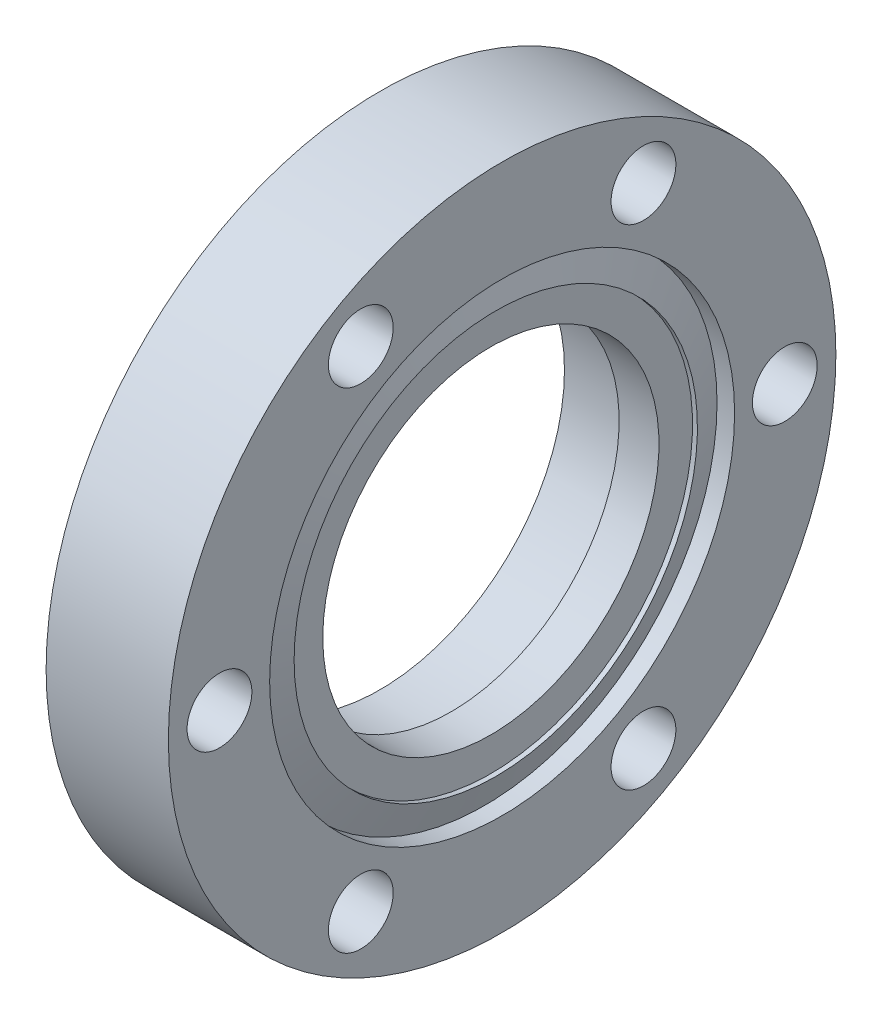
ISO-10303-21;
HEADER;
FILE_DESCRIPTION(('STEP AP214'),'2;1');
FILE_NAME('part.step','',(''),(''),'','','');
FILE_SCHEMA(('AUTOMOTIVE_DESIGN { 1 0 10303 214 1 1 1 1 }'));
ENDSEC;
DATA;
#1=APPLICATION_CONTEXT('core data for automotive mechanical design processes');
#2=APPLICATION_PROTOCOL_DEFINITION('international standard','automotive_design',2000,#1);
#3=PRODUCT_CONTEXT('',#1,'mechanical');
#4=PRODUCT('Part','Part','',(#3));
#5=PRODUCT_RELATED_PRODUCT_CATEGORY('part','',(#4));
#6=PRODUCT_DEFINITION_FORMATION('','',#4);
#7=PRODUCT_DEFINITION_CONTEXT('part definition',#1,'design');
#8=PRODUCT_DEFINITION('design','',#6,#7);
#9=PRODUCT_DEFINITION_SHAPE('','',#8);
#10=(LENGTH_UNIT() NAMED_UNIT(*) SI_UNIT(.MILLI.,.METRE.));
#11=(NAMED_UNIT(*) PLANE_ANGLE_UNIT() SI_UNIT($,.RADIAN.));
#12=(NAMED_UNIT(*) SI_UNIT($,.STERADIAN.) SOLID_ANGLE_UNIT());
#13=UNCERTAINTY_MEASURE_WITH_UNIT(LENGTH_MEASURE(1.E-05),#10,'distance_accuracy_value','');
#14=(GEOMETRIC_REPRESENTATION_CONTEXT(3) GLOBAL_UNCERTAINTY_ASSIGNED_CONTEXT((#13)) GLOBAL_UNIT_ASSIGNED_CONTEXT((#10,
#11,#12)) REPRESENTATION_CONTEXT('',''));
#15=CARTESIAN_POINT('',(0.,0.,0.));
#16=DIRECTION('',(0.,0.,1.));
#17=DIRECTION('',(1.,0.,0.));
#18=AXIS2_PLACEMENT_3D('',#15,#16,#17);
#19=CARTESIAN_POINT('',(5.18000000000051,-19.2062500000005,0.));
#20=DIRECTION('',(1.,0.,0.));
#21=DIRECTION('',(0.,0.,-1.));
#22=AXIS2_PLACEMENT_3D('',#19,#20,#21);
#23=PLANE('',#22);
#24=CARTESIAN_POINT('',(5.18000000000051,0.,0.));
#25=DIRECTION('',(-1.,0.,0.));
#26=DIRECTION('',(0.,0.,1.));
#27=AXIS2_PLACEMENT_3D('',#24,#25,#26);
#28=CIRCLE('',#27,17.4625);
#29=CARTESIAN_POINT('',(5.18000000000051,0.,17.4625));
#30=VERTEX_POINT('',#29);
#31=EDGE_CURVE('E18',#30,#30,#28,.T.);
#32=ORIENTED_EDGE('',*,*,#31,.T.);
#33=EDGE_LOOP('',(#32));
#34=FACE_BOUND('',#33,.T.);
#35=CARTESIAN_POINT('',(5.18000000000051,0.,0.));
#36=DIRECTION('',(-1.,0.,0.));
#37=DIRECTION('',(0.,0.,1.));
#38=AXIS2_PLACEMENT_3D('',#35,#36,#37);
#39=CIRCLE('',#38,20.950000000001);
#40=CARTESIAN_POINT('',(5.18000000000051,0.,20.950000000001));
#41=VERTEX_POINT('',#40);
#42=EDGE_CURVE('E81',#41,#41,#39,.F.);
#43=ORIENTED_EDGE('',*,*,#42,.T.);
#44=EDGE_LOOP('',(#43));
#45=FACE_BOUND('',#44,.T.);
#46=ADVANCED_FACE('F14',(#34,#45),#23,.T.);
#47=CARTESIAN_POINT('',(3.11069999999995,0.,0.));
#48=DIRECTION('',(-1.,0.,0.));
#49=DIRECTION('',(0.,0.,1.));
#50=AXIS2_PLACEMENT_3D('',#47,#48,#49);
#51=CYLINDRICAL_SURFACE('',#50,17.4625);
#52=CARTESIAN_POINT('',(1.04139999999939,0.,0.));
#53=DIRECTION('',(-1.,0.,0.));
#54=DIRECTION('',(0.,0.,1.));
#55=AXIS2_PLACEMENT_3D('',#52,#53,#54);
#56=CIRCLE('',#55,17.4625);
#57=CARTESIAN_POINT('',(1.04139999999939,0.,17.4625));
#58=VERTEX_POINT('',#57);
#59=EDGE_CURVE('E79',#58,#58,#56,.F.);
#60=ORIENTED_EDGE('',*,*,#59,.F.);
#61=EDGE_LOOP('',(#60));
#62=FACE_BOUND('',#61,.T.);
#63=ORIENTED_EDGE('',*,*,#31,.F.);
#64=EDGE_LOOP('',(#63));
#65=FACE_BOUND('',#64,.T.);
#66=ADVANCED_FACE('F89',(#62,#65),#51,.F.);
#67=CARTESIAN_POINT('',(5.43499999999988,0.,0.));
#68=DIRECTION('',(-1.,0.,0.));
#69=DIRECTION('',(0.,0.,1.));
#70=AXIS2_PLACEMENT_3D('',#67,#68,#69);
#71=CYLINDRICAL_SURFACE('',#70,20.950000000001);
#72=ORIENTED_EDGE('',*,*,#42,.F.);
#73=EDGE_LOOP('',(#72));
#74=FACE_BOUND('',#73,.T.);
#75=CARTESIAN_POINT('',(5.69000000223288,0.,0.));
#76=DIRECTION('',(-1.,0.,0.));
#77=DIRECTION('',(0.,-1.,0.));
#78=AXIS2_PLACEMENT_3D('',#75,#76,#77);
#79=CIRCLE('',#78,20.950000000814);
#80=CARTESIAN_POINT('',(5.69000000223288,-20.950000000814,0.));
#81=VERTEX_POINT('',#80);
#82=EDGE_CURVE('E78',#81,#81,#79,.T.);
#83=ORIENTED_EDGE('',*,*,#82,.F.);
#84=EDGE_LOOP('',(#83));
#85=FACE_BOUND('',#84,.T.);
#86=ADVANCED_FACE('F91',(#74,#85),#71,.F.);
#87=CARTESIAN_POINT('',(1.04139999999939,-18.3197499999999,0.));
#88=DIRECTION('',(-1.,0.,0.));
#89=DIRECTION('',(0.,0.,1.));
#90=AXIS2_PLACEMENT_3D('',#87,#88,#89);
#91=PLANE('',#90);
#92=ORIENTED_EDGE('',*,*,#59,.T.);
#93=EDGE_LOOP('',(#92));
#94=FACE_BOUND('',#93,.T.);
#95=CARTESIAN_POINT('',(1.04139999999939,0.,0.));
#96=DIRECTION('',(-1.,0.,0.));
#97=DIRECTION('',(0.,0.,1.));
#98=AXIS2_PLACEMENT_3D('',#95,#96,#97);
#99=CIRCLE('',#98,19.1769999999999);
#100=CARTESIAN_POINT('',(1.04139999999939,0.,19.1769999999999));
#101=VERTEX_POINT('',#100);
#102=EDGE_CURVE('E75',#101,#101,#99,.T.);
#103=ORIENTED_EDGE('',*,*,#102,.T.);
#104=EDGE_LOOP('',(#103));
#105=FACE_BOUND('',#104,.T.);
#106=ADVANCED_FACE('F99',(#94,#105),#91,.T.);
#107=CARTESIAN_POINT('',(4.52529524811392,0.,0.));
#108=DIRECTION('',(-1.,0.,0.));
#109=DIRECTION('',(0.,0.,1.));
#110=AXIS2_PLACEMENT_3D('',#107,#108,#109);
#111=CONICAL_SURFACE('',#110,24.1499999991873,1.22173047499998);
#112=ORIENTED_EDGE('',*,*,#82,.T.);
#113=EDGE_LOOP('',(#112));
#114=FACE_BOUND('',#113,.T.);
#115=CARTESIAN_POINT('',(4.52529525034756,0.,0.));
#116=DIRECTION('',(-1.,0.,0.));
#117=DIRECTION('',(0.,0.,1.));
#118=AXIS2_PLACEMENT_3D('',#115,#116,#117);
#119=CIRCLE('',#118,24.1500000000003);
#120=CARTESIAN_POINT('',(4.52529525034756,0.,24.1500000000003));
#121=VERTEX_POINT('',#120);
#122=EDGE_CURVE('E74',#121,#121,#119,.F.);
#123=ORIENTED_EDGE('',*,*,#122,.T.);
#124=EDGE_LOOP('',(#123));
#125=FACE_BOUND('',#124,.T.);
#126=ADVANCED_FACE('F127',(#114,#125),#111,.T.);
#127=CARTESIAN_POINT('',(-2.65429999999995,0.,0.));
#128=DIRECTION('',(-1.,0.,0.));
#129=DIRECTION('',(0.,0.,1.));
#130=AXIS2_PLACEMENT_3D('',#127,#128,#129);
#131=CYLINDRICAL_SURFACE('',#130,19.1769999999999);
#132=CARTESIAN_POINT('',(-6.34999999999929,0.,0.));
#133=DIRECTION('',(-1.,0.,0.));
#134=DIRECTION('',(0.,0.,1.));
#135=AXIS2_PLACEMENT_3D('',#132,#133,#134);
#136=CIRCLE('',#135,19.1769999999999);
#137=CARTESIAN_POINT('',(-6.34999999999929,0.,19.1769999999999));
#138=VERTEX_POINT('',#137);
#139=EDGE_CURVE('E53',#138,#138,#136,.F.);
#140=ORIENTED_EDGE('',*,*,#139,.F.);
#141=EDGE_LOOP('',(#140));
#142=FACE_BOUND('',#141,.T.);
#143=ORIENTED_EDGE('',*,*,#102,.F.);
#144=EDGE_LOOP('',(#143));
#145=FACE_BOUND('',#144,.T.);
#146=ADVANCED_FACE('F123',(#142,#145),#131,.F.);
#147=CARTESIAN_POINT('',(6.34999999999939,-25.4285843160799,14.6811999999998));
#148=DIRECTION('',(-1.,0.,0.));
#149=DIRECTION('',(0.,0.,1.));
#150=AXIS2_PLACEMENT_3D('',#147,#148,#149);
#151=CYLINDRICAL_SURFACE('',#150,3.36550000000002);
#152=CARTESIAN_POINT('',(6.34999999999937,-25.4285843160799,14.6811999999998));
#153=DIRECTION('',(-1.,0.,0.));
#154=DIRECTION('',(0.,0.,1.));
#155=AXIS2_PLACEMENT_3D('',#152,#153,#154);
#156=CIRCLE('',#155,3.36550000000002);
#157=CARTESIAN_POINT('',(6.34999999999937,-25.4285843160799,18.0466999999999));
#158=VERTEX_POINT('',#157);
#159=EDGE_CURVE('E50',#158,#158,#156,.T.);
#160=ORIENTED_EDGE('',*,*,#159,.F.);
#161=EDGE_LOOP('',(#160));
#162=FACE_BOUND('',#161,.T.);
#163=CARTESIAN_POINT('',(-6.34999999999929,-25.4285843160799,14.6811999999998));
#164=DIRECTION('',(-1.,0.,0.));
#165=DIRECTION('',(0.,0.,1.));
#166=AXIS2_PLACEMENT_3D('',#163,#164,#165);
#167=CIRCLE('',#166,3.36550000000002);
#168=CARTESIAN_POINT('',(-6.34999999999929,-25.4285843160799,18.0466999999999));
#169=VERTEX_POINT('',#168);
#170=EDGE_CURVE('E71',#169,#169,#167,.F.);
#171=ORIENTED_EDGE('',*,*,#170,.F.);
#172=EDGE_LOOP('',(#171));
#173=FACE_BOUND('',#172,.T.);
#174=ADVANCED_FACE('F126',(#162,#173),#151,.F.);
#175=CARTESIAN_POINT('',(6.34999999999939,0.,29.3623999999996));
#176=DIRECTION('',(-1.,0.,0.));
#177=DIRECTION('',(0.,0.,1.));
#178=AXIS2_PLACEMENT_3D('',#175,#176,#177);
#179=CYLINDRICAL_SURFACE('',#178,3.3655);
#180=CARTESIAN_POINT('',(6.34999999999937,0.,29.3623999999996));
#181=DIRECTION('',(-1.,0.,0.));
#182=DIRECTION('',(0.,0.,1.));
#183=AXIS2_PLACEMENT_3D('',#180,#181,#182);
#184=CIRCLE('',#183,3.3655);
#185=CARTESIAN_POINT('',(6.34999999999937,0.,32.7278999999996));
#186=VERTEX_POINT('',#185);
#187=EDGE_CURVE('E47',#186,#186,#184,.T.);
#188=ORIENTED_EDGE('',*,*,#187,.F.);
#189=EDGE_LOOP('',(#188));
#190=FACE_BOUND('',#189,.T.);
#191=CARTESIAN_POINT('',(-6.34999999999929,0.,29.3623999999996));
#192=DIRECTION('',(-1.,0.,0.));
#193=DIRECTION('',(0.,0.,1.));
#194=AXIS2_PLACEMENT_3D('',#191,#192,#193);
#195=CIRCLE('',#194,3.3655);
#196=CARTESIAN_POINT('',(-6.34999999999929,0.,32.7278999999996));
#197=VERTEX_POINT('',#196);
#198=EDGE_CURVE('E68',#197,#197,#195,.F.);
#199=ORIENTED_EDGE('',*,*,#198,.F.);
#200=EDGE_LOOP('',(#199));
#201=FACE_BOUND('',#200,.T.);
#202=ADVANCED_FACE('F157',(#190,#201),#179,.F.);
#203=CARTESIAN_POINT('',(6.34999999999939,25.4285843160799,14.6811999999998));
#204=DIRECTION('',(-1.,0.,0.));
#205=DIRECTION('',(0.,0.,1.));
#206=AXIS2_PLACEMENT_3D('',#203,#204,#205);
#207=CYLINDRICAL_SURFACE('',#206,3.36549999999999);
#208=CARTESIAN_POINT('',(6.34999999999937,25.4285843160799,14.6811999999998));
#209=DIRECTION('',(-1.,0.,0.));
#210=DIRECTION('',(0.,0.,1.));
#211=AXIS2_PLACEMENT_3D('',#208,#209,#210);
#212=CIRCLE('',#211,3.36549999999999);
#213=CARTESIAN_POINT('',(6.34999999999937,25.4285843160799,18.0466999999998));
#214=VERTEX_POINT('',#213);
#215=EDGE_CURVE('E44',#214,#214,#212,.T.);
#216=ORIENTED_EDGE('',*,*,#215,.F.);
#217=EDGE_LOOP('',(#216));
#218=FACE_BOUND('',#217,.T.);
#219=CARTESIAN_POINT('',(-6.34999999999929,25.4285843160799,14.6811999999998));
#220=DIRECTION('',(-1.,0.,0.));
#221=DIRECTION('',(0.,0.,1.));
#222=AXIS2_PLACEMENT_3D('',#219,#220,#221);
#223=CIRCLE('',#222,3.36549999999999);
#224=CARTESIAN_POINT('',(-6.34999999999929,25.4285843160799,18.0466999999998));
#225=VERTEX_POINT('',#224);
#226=EDGE_CURVE('E65',#225,#225,#223,.F.);
#227=ORIENTED_EDGE('',*,*,#226,.F.);
#228=EDGE_LOOP('',(#227));
#229=FACE_BOUND('',#228,.T.);
#230=ADVANCED_FACE('F165',(#218,#229),#207,.F.);
#231=CARTESIAN_POINT('',(6.34999999999939,25.4285843160799,-14.6811999999998));
#232=DIRECTION('',(-1.,0.,0.));
#233=DIRECTION('',(0.,0.,1.));
#234=AXIS2_PLACEMENT_3D('',#231,#232,#233);
#235=CYLINDRICAL_SURFACE('',#234,3.3655);
#236=CARTESIAN_POINT('',(6.34999999999937,25.4285843160799,-14.6811999999998));
#237=DIRECTION('',(-1.,0.,0.));
#238=DIRECTION('',(0.,0.,1.));
#239=AXIS2_PLACEMENT_3D('',#236,#237,#238);
#240=CIRCLE('',#239,3.3655);
#241=CARTESIAN_POINT('',(6.34999999999937,25.4285843160799,-11.3156999999998));
#242=VERTEX_POINT('',#241);
#243=EDGE_CURVE('E41',#242,#242,#240,.T.);
#244=ORIENTED_EDGE('',*,*,#243,.F.);
#245=EDGE_LOOP('',(#244));
#246=FACE_BOUND('',#245,.T.);
#247=CARTESIAN_POINT('',(-6.34999999999929,25.4285843160799,-14.6811999999998));
#248=DIRECTION('',(-1.,0.,0.));
#249=DIRECTION('',(0.,0.,1.));
#250=AXIS2_PLACEMENT_3D('',#247,#248,#249);
#251=CIRCLE('',#250,3.3655);
#252=CARTESIAN_POINT('',(-6.34999999999929,25.4285843160799,-11.3156999999998));
#253=VERTEX_POINT('',#252);
#254=EDGE_CURVE('E62',#253,#253,#251,.F.);
#255=ORIENTED_EDGE('',*,*,#254,.F.);
#256=EDGE_LOOP('',(#255));
#257=FACE_BOUND('',#256,.T.);
#258=ADVANCED_FACE('F173',(#246,#257),#235,.F.);
#259=CARTESIAN_POINT('',(6.34999999999939,-25.4285843160799,-14.6811999999998));
#260=DIRECTION('',(-1.,0.,0.));
#261=DIRECTION('',(0.,0.,1.));
#262=AXIS2_PLACEMENT_3D('',#259,#260,#261);
#263=CYLINDRICAL_SURFACE('',#262,3.3655);
#264=CARTESIAN_POINT('',(6.34999999999937,-25.4285843160799,-14.6811999999998));
#265=DIRECTION('',(-1.,0.,0.));
#266=DIRECTION('',(0.,0.,1.));
#267=AXIS2_PLACEMENT_3D('',#264,#265,#266);
#268=CIRCLE('',#267,3.3655);
#269=CARTESIAN_POINT('',(6.34999999999937,-25.4285843160799,-11.3156999999998));
#270=VERTEX_POINT('',#269);
#271=EDGE_CURVE('E38',#270,#270,#268,.T.);
#272=ORIENTED_EDGE('',*,*,#271,.F.);
#273=EDGE_LOOP('',(#272));
#274=FACE_BOUND('',#273,.T.);
#275=CARTESIAN_POINT('',(-6.34999999999929,-25.4285843160799,-14.6811999999998));
#276=DIRECTION('',(-1.,0.,0.));
#277=DIRECTION('',(0.,0.,1.));
#278=AXIS2_PLACEMENT_3D('',#275,#276,#277);
#279=CIRCLE('',#278,3.3655);
#280=CARTESIAN_POINT('',(-6.34999999999929,-25.4285843160799,-11.3156999999998));
#281=VERTEX_POINT('',#280);
#282=EDGE_CURVE('E59',#281,#281,#279,.F.);
#283=ORIENTED_EDGE('',*,*,#282,.F.);
#284=EDGE_LOOP('',(#283));
#285=FACE_BOUND('',#284,.T.);
#286=ADVANCED_FACE('F181',(#274,#285),#263,.F.);
#287=CARTESIAN_POINT('',(6.34999999999939,0.,-29.3623999999996));
#288=DIRECTION('',(-1.,0.,0.));
#289=DIRECTION('',(0.,0.,1.));
#290=AXIS2_PLACEMENT_3D('',#287,#288,#289);
#291=CYLINDRICAL_SURFACE('',#290,3.3655);
#292=CARTESIAN_POINT('',(6.34999999999937,0.,-29.3623999999996));
#293=DIRECTION('',(-1.,0.,0.));
#294=DIRECTION('',(0.,0.,1.));
#295=AXIS2_PLACEMENT_3D('',#292,#293,#294);
#296=CIRCLE('',#295,3.3655);
#297=CARTESIAN_POINT('',(6.34999999999937,0.,-25.9968999999996));
#298=VERTEX_POINT('',#297);
#299=EDGE_CURVE('E35',#298,#298,#296,.T.);
#300=ORIENTED_EDGE('',*,*,#299,.F.);
#301=EDGE_LOOP('',(#300));
#302=FACE_BOUND('',#301,.T.);
#303=CARTESIAN_POINT('',(-6.34999999999929,0.,-29.3623999999996));
#304=DIRECTION('',(-1.,0.,0.));
#305=DIRECTION('',(0.,0.,1.));
#306=AXIS2_PLACEMENT_3D('',#303,#304,#305);
#307=CIRCLE('',#306,3.3655);
#308=CARTESIAN_POINT('',(-6.34999999999929,0.,-25.9968999999996));
#309=VERTEX_POINT('',#308);
#310=EDGE_CURVE('E56',#309,#309,#307,.F.);
#311=ORIENTED_EDGE('',*,*,#310,.F.);
#312=EDGE_LOOP('',(#311));
#313=FACE_BOUND('',#312,.T.);
#314=ADVANCED_FACE('F16',(#302,#313),#291,.F.);
#315=CARTESIAN_POINT('',(5.43764762517347,0.,0.));
#316=DIRECTION('',(-1.,0.,0.));
#317=DIRECTION('',(0.,0.,1.));
#318=AXIS2_PLACEMENT_3D('',#315,#316,#317);
#319=CYLINDRICAL_SURFACE('',#318,24.1500000000003);
#320=ORIENTED_EDGE('',*,*,#122,.F.);
#321=EDGE_LOOP('',(#320));
#322=FACE_BOUND('',#321,.T.);
#323=CARTESIAN_POINT('',(6.34999999999937,0.,0.));
#324=DIRECTION('',(-1.,0.,0.));
#325=DIRECTION('',(0.,0.,1.));
#326=AXIS2_PLACEMENT_3D('',#323,#324,#325);
#327=CIRCLE('',#326,24.1500000000003);
#328=CARTESIAN_POINT('',(6.34999999999937,0.,24.1500000000003));
#329=VERTEX_POINT('',#328);
#330=EDGE_CURVE('E27',#329,#329,#327,.T.);
#331=ORIENTED_EDGE('',*,*,#330,.F.);
#332=EDGE_LOOP('',(#331));
#333=FACE_BOUND('',#332,.T.);
#334=ADVANCED_FACE('F118',(#322,#333),#319,.F.);
#335=CARTESIAN_POINT('',(-6.34999999999929,-26.9240000000001,0.));
#336=DIRECTION('',(-1.,0.,0.));
#337=DIRECTION('',(0.,0.,1.));
#338=AXIS2_PLACEMENT_3D('',#335,#336,#337);
#339=PLANE('',#338);
#340=ORIENTED_EDGE('',*,*,#139,.T.);
#341=EDGE_LOOP('',(#340));
#342=FACE_BOUND('',#341,.T.);
#343=ORIENTED_EDGE('',*,*,#310,.T.);
#344=EDGE_LOOP('',(#343));
#345=FACE_BOUND('',#344,.T.);
#346=ORIENTED_EDGE('',*,*,#282,.T.);
#347=EDGE_LOOP('',(#346));
#348=FACE_BOUND('',#347,.T.);
#349=ORIENTED_EDGE('',*,*,#254,.T.);
#350=EDGE_LOOP('',(#349));
#351=FACE_BOUND('',#350,.T.);
#352=ORIENTED_EDGE('',*,*,#226,.T.);
#353=EDGE_LOOP('',(#352));
#354=FACE_BOUND('',#353,.T.);
#355=ORIENTED_EDGE('',*,*,#198,.T.);
#356=EDGE_LOOP('',(#355));
#357=FACE_BOUND('',#356,.T.);
#358=ORIENTED_EDGE('',*,*,#170,.T.);
#359=EDGE_LOOP('',(#358));
#360=FACE_BOUND('',#359,.T.);
#361=CARTESIAN_POINT('',(-6.34999999999929,0.,0.));
#362=DIRECTION('',(-1.,0.,0.));
#363=DIRECTION('',(0.,0.,1.));
#364=AXIS2_PLACEMENT_3D('',#361,#362,#363);
#365=CIRCLE('',#364,34.6710000000003);
#366=CARTESIAN_POINT('',(-6.34999999999929,0.,34.6710000000003));
#367=VERTEX_POINT('',#366);
#368=EDGE_CURVE('E22',#367,#367,#365,.F.);
#369=ORIENTED_EDGE('',*,*,#368,.F.);
#370=EDGE_LOOP('',(#369));
#371=FACE_BOUND('',#370,.T.);
#372=ADVANCED_FACE('F111',(#342,#345,#348,#351,#354,#357,#360,#371),#339,.T.);
#373=CARTESIAN_POINT('',(6.34999999999937,-29.4105000000003,0.));
#374=DIRECTION('',(1.,0.,0.));
#375=DIRECTION('',(0.,0.,-1.));
#376=AXIS2_PLACEMENT_3D('',#373,#374,#375);
#377=PLANE('',#376);
#378=ORIENTED_EDGE('',*,*,#330,.T.);
#379=EDGE_LOOP('',(#378));
#380=FACE_BOUND('',#379,.T.);
#381=ORIENTED_EDGE('',*,*,#299,.T.);
#382=EDGE_LOOP('',(#381));
#383=FACE_BOUND('',#382,.T.);
#384=ORIENTED_EDGE('',*,*,#271,.T.);
#385=EDGE_LOOP('',(#384));
#386=FACE_BOUND('',#385,.T.);
#387=ORIENTED_EDGE('',*,*,#243,.T.);
#388=EDGE_LOOP('',(#387));
#389=FACE_BOUND('',#388,.T.);
#390=ORIENTED_EDGE('',*,*,#215,.T.);
#391=EDGE_LOOP('',(#390));
#392=FACE_BOUND('',#391,.T.);
#393=ORIENTED_EDGE('',*,*,#187,.T.);
#394=EDGE_LOOP('',(#393));
#395=FACE_BOUND('',#394,.T.);
#396=ORIENTED_EDGE('',*,*,#159,.T.);
#397=EDGE_LOOP('',(#396));
#398=FACE_BOUND('',#397,.T.);
#399=CARTESIAN_POINT('',(6.34999999999937,0.,0.));
#400=DIRECTION('',(-1.,0.,0.));
#401=DIRECTION('',(0.,0.,1.));
#402=AXIS2_PLACEMENT_3D('',#399,#400,#401);
#403=CIRCLE('',#402,34.6710000000003);
#404=CARTESIAN_POINT('',(6.34999999999937,0.,34.6710000000003));
#405=VERTEX_POINT('',#404);
#406=EDGE_CURVE('E10',#405,#405,#403,.T.);
#407=ORIENTED_EDGE('',*,*,#406,.F.);
#408=EDGE_LOOP('',(#407));
#409=FACE_BOUND('',#408,.T.);
#410=ADVANCED_FACE('F106',(#380,#383,#386,#389,#392,#395,#398,#409),#377,.T.);
#411=CARTESIAN_POINT('',(0.,0.,0.));
#412=DIRECTION('',(-1.,0.,0.));
#413=DIRECTION('',(0.,0.,1.));
#414=AXIS2_PLACEMENT_3D('',#411,#412,#413);
#415=CYLINDRICAL_SURFACE('',#414,34.6710000000003);
#416=ORIENTED_EDGE('',*,*,#406,.T.);
#417=EDGE_LOOP('',(#416));
#418=FACE_BOUND('',#417,.T.);
#419=ORIENTED_EDGE('',*,*,#368,.T.);
#420=EDGE_LOOP('',(#419));
#421=FACE_BOUND('',#420,.T.);
#422=ADVANCED_FACE('F104',(#418,#421),#415,.T.);
#423=CLOSED_SHELL('',(#46,#66,#86,#106,#126,#146,#174,#202,#230,#258,#286,#314,#334,#372,#410,#422));
#424=MANIFOLD_SOLID_BREP('B1',#423);
#425=ADVANCED_BREP_SHAPE_REPRESENTATION('',(#18,#424),#14);
#426=SHAPE_DEFINITION_REPRESENTATION(#9,#425);
ENDSEC;
END-ISO-10303-21;
